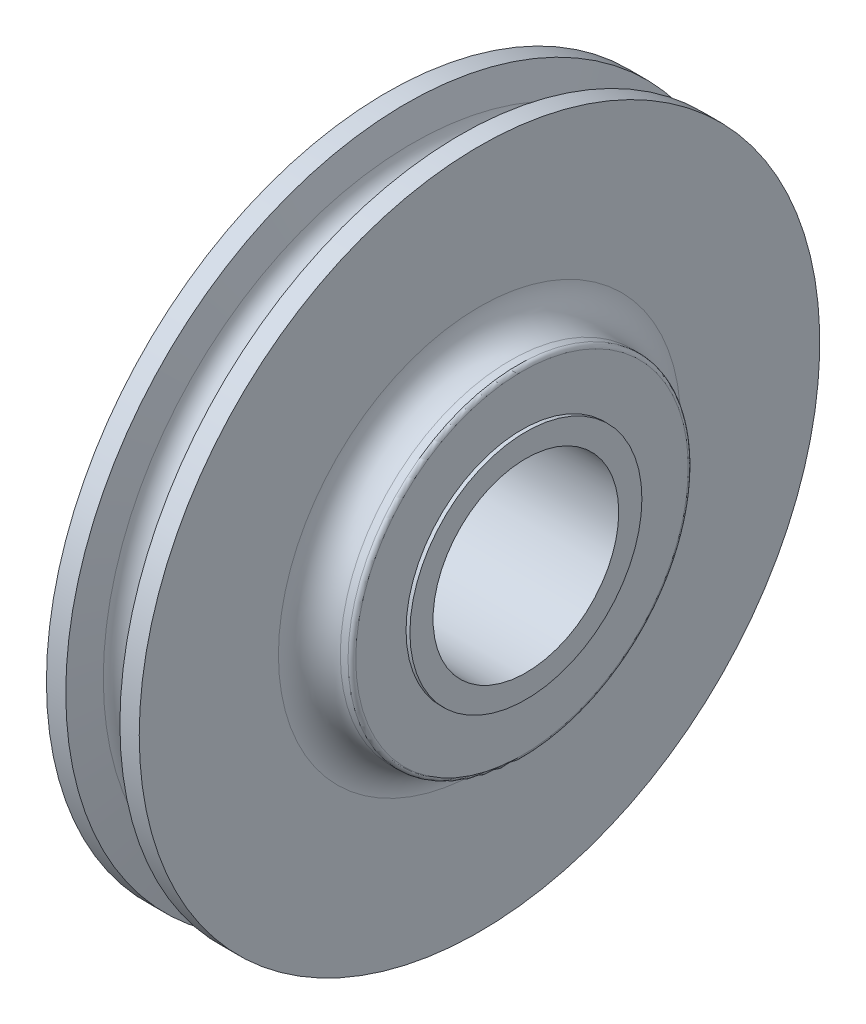
ISO-10303-21;
HEADER;
FILE_DESCRIPTION(('STEP AP214'),'2;1');
FILE_NAME('part.step','',(''),(''),'','','');
FILE_SCHEMA(('AUTOMOTIVE_DESIGN { 1 0 10303 214 1 1 1 1 }'));
ENDSEC;
DATA;
#1=APPLICATION_CONTEXT('core data for automotive mechanical design processes');
#2=APPLICATION_PROTOCOL_DEFINITION('international standard','automotive_design',2000,#1);
#3=PRODUCT_CONTEXT('',#1,'mechanical');
#4=PRODUCT('Part','Part','',(#3));
#5=PRODUCT_RELATED_PRODUCT_CATEGORY('part','',(#4));
#6=PRODUCT_DEFINITION_FORMATION('','',#4);
#7=PRODUCT_DEFINITION_CONTEXT('part definition',#1,'design');
#8=PRODUCT_DEFINITION('design','',#6,#7);
#9=PRODUCT_DEFINITION_SHAPE('','',#8);
#10=(LENGTH_UNIT() NAMED_UNIT(*) SI_UNIT(.MILLI.,.METRE.));
#11=(NAMED_UNIT(*) PLANE_ANGLE_UNIT() SI_UNIT($,.RADIAN.));
#12=(NAMED_UNIT(*) SI_UNIT($,.STERADIAN.) SOLID_ANGLE_UNIT());
#13=UNCERTAINTY_MEASURE_WITH_UNIT(LENGTH_MEASURE(1.E-05),#10,'distance_accuracy_value','');
#14=(GEOMETRIC_REPRESENTATION_CONTEXT(3) GLOBAL_UNCERTAINTY_ASSIGNED_CONTEXT((#13)) GLOBAL_UNIT_ASSIGNED_CONTEXT((#10,
#11,#12)) REPRESENTATION_CONTEXT('',''));
#15=CARTESIAN_POINT('',(0.,0.,0.));
#16=DIRECTION('',(0.,0.,1.));
#17=DIRECTION('',(1.,0.,0.));
#18=AXIS2_PLACEMENT_3D('',#15,#16,#17);
#19=CARTESIAN_POINT('',(31.75,0.,0.));
#20=DIRECTION('',(-1.,0.,0.));
#21=DIRECTION('',(0.,0.,1.));
#22=AXIS2_PLACEMENT_3D('',#19,#20,#21);
#23=TOROIDAL_SURFACE('',#22,82.5499999999997,12.7);
#24=CARTESIAN_POINT('',(19.05,0.,0.));
#25=DIRECTION('',(-1.,0.,0.));
#26=DIRECTION('',(0.,0.,1.));
#27=AXIS2_PLACEMENT_3D('',#24,#25,#26);
#28=CIRCLE('',#27,82.5499999999997);
#29=CARTESIAN_POINT('',(19.05,0.,82.5499999999997));
#30=VERTEX_POINT('',#29);
#31=EDGE_CURVE('E10',#30,#30,#28,.T.);
#32=ORIENTED_EDGE('',*,*,#31,.F.);
#33=EDGE_LOOP('',(#32));
#34=FACE_BOUND('',#33,.T.);
#35=CARTESIAN_POINT('',(31.75,0.,0.));
#36=DIRECTION('',(-1.,0.,0.));
#37=DIRECTION('',(0.,0.,1.));
#38=AXIS2_PLACEMENT_3D('',#35,#36,#37);
#39=CIRCLE('',#38,69.8499999999997);
#40=CARTESIAN_POINT('',(31.75,0.,69.8499999999997));
#41=VERTEX_POINT('',#40);
#42=EDGE_CURVE('E429',#41,#41,#39,.T.);
#43=ORIENTED_EDGE('',*,*,#42,.T.);
#44=EDGE_LOOP('',(#43));
#45=FACE_BOUND('',#44,.T.);
#46=ADVANCED_FACE('F371',(#34,#45),#23,.F.);
#47=CARTESIAN_POINT('',(19.05,139.7,0.));
#48=DIRECTION('',(-1.,0.,0.));
#49=DIRECTION('',(0.,0.,1.));
#50=AXIS2_PLACEMENT_3D('',#47,#48,#49);
#51=PLANE('',#50);
#52=CARTESIAN_POINT('',(19.05,0.,0.));
#53=DIRECTION('',(-1.,0.,0.));
#54=DIRECTION('',(0.,0.,1.));
#55=AXIS2_PLACEMENT_3D('',#52,#53,#54);
#56=CIRCLE('',#55,139.7);
#57=CARTESIAN_POINT('',(19.05,0.,139.7));
#58=VERTEX_POINT('',#57);
#59=EDGE_CURVE('E377',#58,#58,#56,.T.);
#60=ORIENTED_EDGE('',*,*,#59,.F.);
#61=EDGE_LOOP('',(#60));
#62=FACE_BOUND('',#61,.T.);
#63=ORIENTED_EDGE('',*,*,#31,.T.);
#64=EDGE_LOOP('',(#63));
#65=FACE_BOUND('',#64,.T.);
#66=ADVANCED_FACE('F462',(#62,#65),#51,.F.);
#67=CARTESIAN_POINT('',(-38.1,0.,0.));
#68=DIRECTION('',(-1.,0.,0.));
#69=DIRECTION('',(0.,0.,1.));
#70=AXIS2_PLACEMENT_3D('',#67,#68,#69);
#71=CYLINDRICAL_SURFACE('',#70,139.7);
#72=CARTESIAN_POINT('',(11.1125,0.,0.));
#73=DIRECTION('',(-1.,0.,0.));
#74=DIRECTION('',(0.,0.,1.));
#75=AXIS2_PLACEMENT_3D('',#72,#73,#74);
#76=CIRCLE('',#75,139.7);
#77=CARTESIAN_POINT('',(11.1125,0.,139.7));
#78=VERTEX_POINT('',#77);
#79=EDGE_CURVE('E381',#78,#78,#76,.T.);
#80=ORIENTED_EDGE('',*,*,#79,.F.);
#81=EDGE_LOOP('',(#80));
#82=FACE_BOUND('',#81,.T.);
#83=ORIENTED_EDGE('',*,*,#59,.T.);
#84=EDGE_LOOP('',(#83));
#85=FACE_BOUND('',#84,.T.);
#86=ADVANCED_FACE('F467',(#82,#85),#71,.T.);
#87=CARTESIAN_POINT('',(11.1125,0.,0.));
#88=DIRECTION('',(1.,0.,0.));
#89=DIRECTION('',(0.,0.,-1.));
#90=AXIS2_PLACEMENT_3D('',#87,#88,#89);
#91=CONICAL_SURFACE('',#90,139.7,1.37329185721072);
#92=CARTESIAN_POINT('',(8.5428288285911,0.,0.));
#93=DIRECTION('',(-1.,0.,0.));
#94=DIRECTION('',(0.,0.,1.));
#95=AXIS2_PLACEMENT_3D('',#92,#93,#94);
#96=CIRCLE('',#95,126.858916600095);
#97=CARTESIAN_POINT('',(8.5428288285911,0.,126.858916600095));
#98=VERTEX_POINT('',#97);
#99=EDGE_CURVE('E385',#98,#98,#96,.T.);
#100=ORIENTED_EDGE('',*,*,#99,.F.);
#101=EDGE_LOOP('',(#100));
#102=FACE_BOUND('',#101,.T.);
#103=ORIENTED_EDGE('',*,*,#79,.T.);
#104=EDGE_LOOP('',(#103));
#105=FACE_BOUND('',#104,.T.);
#106=ADVANCED_FACE('F547',(#102,#105),#91,.T.);
#107=CARTESIAN_POINT('',(0.,0.,0.));
#108=DIRECTION('',(-1.,0.,0.));
#109=DIRECTION('',(0.,0.,1.));
#110=AXIS2_PLACEMENT_3D('',#107,#108,#109);
#111=TOROIDAL_SURFACE('',#110,128.56845,8.71219999999997);
#112=CARTESIAN_POINT('',(-8.54282882859091,0.,0.));
#113=DIRECTION('',(-1.,0.,0.));
#114=DIRECTION('',(0.,0.,1.));
#115=AXIS2_PLACEMENT_3D('',#112,#113,#114);
#116=CIRCLE('',#115,126.858916600095);
#117=CARTESIAN_POINT('',(-8.54282882859091,0.,126.858916600095));
#118=VERTEX_POINT('',#117);
#119=EDGE_CURVE('E390',#118,#118,#116,.T.);
#120=ORIENTED_EDGE('',*,*,#119,.F.);
#121=EDGE_LOOP('',(#120));
#122=FACE_BOUND('',#121,.T.);
#123=ORIENTED_EDGE('',*,*,#99,.T.);
#124=EDGE_LOOP('',(#123));
#125=FACE_BOUND('',#124,.T.);
#126=ADVANCED_FACE('F541',(#122,#125),#111,.F.);
#127=CARTESIAN_POINT('',(-8.54282882859091,0.,0.));
#128=DIRECTION('',(-1.,0.,0.));
#129=DIRECTION('',(0.,0.,1.));
#130=AXIS2_PLACEMENT_3D('',#127,#128,#129);
#131=CONICAL_SURFACE('',#130,126.858916600095,1.3732918572107);
#132=CARTESIAN_POINT('',(-11.1125,0.,0.));
#133=DIRECTION('',(-1.,0.,0.));
#134=DIRECTION('',(0.,0.,1.));
#135=AXIS2_PLACEMENT_3D('',#132,#133,#134);
#136=CIRCLE('',#135,139.7);
#137=CARTESIAN_POINT('',(-11.1125,0.,139.7));
#138=VERTEX_POINT('',#137);
#139=EDGE_CURVE('E393',#138,#138,#136,.T.);
#140=ORIENTED_EDGE('',*,*,#139,.F.);
#141=EDGE_LOOP('',(#140));
#142=FACE_BOUND('',#141,.T.);
#143=ORIENTED_EDGE('',*,*,#119,.T.);
#144=EDGE_LOOP('',(#143));
#145=FACE_BOUND('',#144,.T.);
#146=ADVANCED_FACE('F535',(#142,#145),#131,.T.);
#147=CARTESIAN_POINT('',(-38.1,0.,0.));
#148=DIRECTION('',(-1.,0.,0.));
#149=DIRECTION('',(0.,0.,1.));
#150=AXIS2_PLACEMENT_3D('',#147,#148,#149);
#151=CYLINDRICAL_SURFACE('',#150,139.7);
#152=CARTESIAN_POINT('',(-19.05,0.,0.));
#153=DIRECTION('',(-1.,0.,0.));
#154=DIRECTION('',(0.,0.,1.));
#155=AXIS2_PLACEMENT_3D('',#152,#153,#154);
#156=CIRCLE('',#155,139.7);
#157=CARTESIAN_POINT('',(-19.05,0.,139.7));
#158=VERTEX_POINT('',#157);
#159=EDGE_CURVE('E396',#158,#158,#156,.T.);
#160=ORIENTED_EDGE('',*,*,#159,.F.);
#161=EDGE_LOOP('',(#160));
#162=FACE_BOUND('',#161,.T.);
#163=ORIENTED_EDGE('',*,*,#139,.T.);
#164=EDGE_LOOP('',(#163));
#165=FACE_BOUND('',#164,.T.);
#166=ADVANCED_FACE('F529',(#162,#165),#151,.T.);
#167=CARTESIAN_POINT('',(-19.05,139.7,0.));
#168=DIRECTION('',(1.,0.,0.));
#169=DIRECTION('',(0.,0.,-1.));
#170=AXIS2_PLACEMENT_3D('',#167,#168,#169);
#171=PLANE('',#170);
#172=CARTESIAN_POINT('',(-19.05,0.,0.));
#173=DIRECTION('',(-1.,0.,0.));
#174=DIRECTION('',(0.,0.,1.));
#175=AXIS2_PLACEMENT_3D('',#172,#173,#174);
#176=CIRCLE('',#175,82.5499999999997);
#177=CARTESIAN_POINT('',(-19.05,0.,82.5499999999997));
#178=VERTEX_POINT('',#177);
#179=EDGE_CURVE('E399',#178,#178,#176,.T.);
#180=ORIENTED_EDGE('',*,*,#179,.F.);
#181=EDGE_LOOP('',(#180));
#182=FACE_BOUND('',#181,.T.);
#183=ORIENTED_EDGE('',*,*,#159,.T.);
#184=EDGE_LOOP('',(#183));
#185=FACE_BOUND('',#184,.T.);
#186=ADVANCED_FACE('F523',(#182,#185),#171,.F.);
#187=CARTESIAN_POINT('',(-31.75,0.,0.));
#188=DIRECTION('',(-1.,0.,0.));
#189=DIRECTION('',(0.,0.,1.));
#190=AXIS2_PLACEMENT_3D('',#187,#188,#189);
#191=TOROIDAL_SURFACE('',#190,82.5499999999997,12.7);
#192=CARTESIAN_POINT('',(-31.75,0.,0.));
#193=DIRECTION('',(-1.,0.,0.));
#194=DIRECTION('',(0.,0.,1.));
#195=AXIS2_PLACEMENT_3D('',#192,#193,#194);
#196=CIRCLE('',#195,69.8499999999997);
#197=CARTESIAN_POINT('',(-31.75,0.,69.8499999999997));
#198=VERTEX_POINT('',#197);
#199=EDGE_CURVE('E402',#198,#198,#196,.T.);
#200=ORIENTED_EDGE('',*,*,#199,.F.);
#201=EDGE_LOOP('',(#200));
#202=FACE_BOUND('',#201,.T.);
#203=ORIENTED_EDGE('',*,*,#179,.T.);
#204=EDGE_LOOP('',(#203));
#205=FACE_BOUND('',#204,.T.);
#206=ADVANCED_FACE('F517',(#202,#205),#191,.F.);
#207=CARTESIAN_POINT('',(-38.1,0.,0.));
#208=DIRECTION('',(-1.,0.,0.));
#209=DIRECTION('',(0.,0.,1.));
#210=AXIS2_PLACEMENT_3D('',#207,#208,#209);
#211=CYLINDRICAL_SURFACE('',#210,69.8499999999997);
#212=CARTESIAN_POINT('',(-34.925,0.,0.));
#213=DIRECTION('',(-1.,0.,0.));
#214=DIRECTION('',(0.,0.,1.));
#215=AXIS2_PLACEMENT_3D('',#212,#213,#214);
#216=CIRCLE('',#215,69.8499999999997);
#217=CARTESIAN_POINT('',(-34.925,0.,69.8499999999997));
#218=VERTEX_POINT('',#217);
#219=EDGE_CURVE('E405',#218,#218,#216,.T.);
#220=ORIENTED_EDGE('',*,*,#219,.F.);
#221=EDGE_LOOP('',(#220));
#222=FACE_BOUND('',#221,.T.);
#223=ORIENTED_EDGE('',*,*,#199,.T.);
#224=EDGE_LOOP('',(#223));
#225=FACE_BOUND('',#224,.T.);
#226=ADVANCED_FACE('F511',(#222,#225),#211,.T.);
#227=CARTESIAN_POINT('',(-34.925,0.,0.));
#228=DIRECTION('',(-1.,0.,0.));
#229=DIRECTION('',(0.,0.,1.));
#230=AXIS2_PLACEMENT_3D('',#227,#228,#229);
#231=TOROIDAL_SURFACE('',#230,68.2624999999997,1.58749999999999);
#232=CARTESIAN_POINT('',(-36.5125,0.,0.));
#233=DIRECTION('',(-1.,0.,0.));
#234=DIRECTION('',(0.,0.,1.));
#235=AXIS2_PLACEMENT_3D('',#232,#233,#234);
#236=CIRCLE('',#235,68.2624999999997);
#237=CARTESIAN_POINT('',(-36.5125,0.,68.2624999999997));
#238=VERTEX_POINT('',#237);
#239=EDGE_CURVE('E408',#238,#238,#236,.T.);
#240=ORIENTED_EDGE('',*,*,#239,.F.);
#241=EDGE_LOOP('',(#240));
#242=FACE_BOUND('',#241,.T.);
#243=ORIENTED_EDGE('',*,*,#219,.T.);
#244=EDGE_LOOP('',(#243));
#245=FACE_BOUND('',#244,.T.);
#246=ADVANCED_FACE('F505',(#242,#245),#231,.T.);
#247=CARTESIAN_POINT('',(-36.5125,68.2624999999997,0.));
#248=DIRECTION('',(1.,0.,0.));
#249=DIRECTION('',(0.,0.,-1.));
#250=AXIS2_PLACEMENT_3D('',#247,#248,#249);
#251=PLANE('',#250);
#252=CARTESIAN_POINT('',(-36.5125,0.,0.));
#253=DIRECTION('',(-1.,0.,0.));
#254=DIRECTION('',(0.,0.,1.));
#255=AXIS2_PLACEMENT_3D('',#252,#253,#254);
#256=CIRCLE('',#255,47.625);
#257=CARTESIAN_POINT('',(-36.5125,0.,47.625));
#258=VERTEX_POINT('',#257);
#259=EDGE_CURVE('E411',#258,#258,#256,.T.);
#260=ORIENTED_EDGE('',*,*,#259,.F.);
#261=EDGE_LOOP('',(#260));
#262=FACE_BOUND('',#261,.T.);
#263=ORIENTED_EDGE('',*,*,#239,.T.);
#264=EDGE_LOOP('',(#263));
#265=FACE_BOUND('',#264,.T.);
#266=ADVANCED_FACE('F499',(#262,#265),#251,.F.);
#267=CARTESIAN_POINT('',(-38.1,0.,0.));
#268=DIRECTION('',(-1.,0.,0.));
#269=DIRECTION('',(0.,0.,1.));
#270=AXIS2_PLACEMENT_3D('',#267,#268,#269);
#271=CYLINDRICAL_SURFACE('',#270,47.625);
#272=CARTESIAN_POINT('',(-38.1,0.,0.));
#273=DIRECTION('',(-1.,0.,0.));
#274=DIRECTION('',(0.,0.,1.));
#275=AXIS2_PLACEMENT_3D('',#272,#273,#274);
#276=CIRCLE('',#275,47.625);
#277=CARTESIAN_POINT('',(-38.1,0.,47.625));
#278=VERTEX_POINT('',#277);
#279=EDGE_CURVE('E414',#278,#278,#276,.T.);
#280=ORIENTED_EDGE('',*,*,#279,.F.);
#281=EDGE_LOOP('',(#280));
#282=FACE_BOUND('',#281,.T.);
#283=ORIENTED_EDGE('',*,*,#259,.T.);
#284=EDGE_LOOP('',(#283));
#285=FACE_BOUND('',#284,.T.);
#286=ADVANCED_FACE('F494',(#282,#285),#271,.T.);
#287=CARTESIAN_POINT('',(-38.1,47.625,0.));
#288=DIRECTION('',(1.,0.,0.));
#289=DIRECTION('',(0.,0.,-1.));
#290=AXIS2_PLACEMENT_3D('',#287,#288,#289);
#291=PLANE('',#290);
#292=CARTESIAN_POINT('',(-38.1,0.,0.));
#293=DIRECTION('',(1.,0.,0.));
#294=DIRECTION('',(0.,0.,-1.));
#295=AXIS2_PLACEMENT_3D('',#292,#293,#294);
#296=CIRCLE('',#295,38.1127);
#297=CARTESIAN_POINT('',(-38.1,0.,-38.1127));
#298=VERTEX_POINT('',#297);
#299=EDGE_CURVE('E432',#298,#298,#296,.T.);
#300=ORIENTED_EDGE('',*,*,#299,.T.);
#301=EDGE_LOOP('',(#300));
#302=FACE_BOUND('',#301,.T.);
#303=ORIENTED_EDGE('',*,*,#279,.T.);
#304=EDGE_LOOP('',(#303));
#305=FACE_BOUND('',#304,.T.);
#306=ADVANCED_FACE('F445',(#302,#305),#291,.F.);
#307=CARTESIAN_POINT('',(38.1,47.625,0.));
#308=DIRECTION('',(-1.,0.,0.));
#309=DIRECTION('',(0.,0.,1.));
#310=AXIS2_PLACEMENT_3D('',#307,#308,#309);
#311=PLANE('',#310);
#312=CARTESIAN_POINT('',(38.1,0.,0.));
#313=DIRECTION('',(1.,0.,0.));
#314=DIRECTION('',(0.,0.,-1.));
#315=AXIS2_PLACEMENT_3D('',#312,#313,#314);
#316=CIRCLE('',#315,38.1127);
#317=CARTESIAN_POINT('',(38.1,0.,-38.1127));
#318=VERTEX_POINT('',#317);
#319=EDGE_CURVE('E435',#318,#318,#316,.T.);
#320=ORIENTED_EDGE('',*,*,#319,.F.);
#321=EDGE_LOOP('',(#320));
#322=FACE_BOUND('',#321,.T.);
#323=CARTESIAN_POINT('',(38.1,0.,0.));
#324=DIRECTION('',(-1.,0.,0.));
#325=DIRECTION('',(0.,0.,1.));
#326=AXIS2_PLACEMENT_3D('',#323,#324,#325);
#327=CIRCLE('',#326,47.625);
#328=CARTESIAN_POINT('',(38.1,0.,47.625));
#329=VERTEX_POINT('',#328);
#330=EDGE_CURVE('E417',#329,#329,#327,.T.);
#331=ORIENTED_EDGE('',*,*,#330,.F.);
#332=EDGE_LOOP('',(#331));
#333=FACE_BOUND('',#332,.T.);
#334=ADVANCED_FACE('F441',(#322,#333),#311,.F.);
#335=CARTESIAN_POINT('',(-38.1,0.,0.));
#336=DIRECTION('',(-1.,0.,0.));
#337=DIRECTION('',(0.,0.,1.));
#338=AXIS2_PLACEMENT_3D('',#335,#336,#337);
#339=CYLINDRICAL_SURFACE('',#338,47.625);
#340=CARTESIAN_POINT('',(36.5125,0.,0.));
#341=DIRECTION('',(-1.,0.,0.));
#342=DIRECTION('',(0.,0.,1.));
#343=AXIS2_PLACEMENT_3D('',#340,#341,#342);
#344=CIRCLE('',#343,47.625);
#345=CARTESIAN_POINT('',(36.5125,0.,47.625));
#346=VERTEX_POINT('',#345);
#347=EDGE_CURVE('E420',#346,#346,#344,.T.);
#348=ORIENTED_EDGE('',*,*,#347,.F.);
#349=EDGE_LOOP('',(#348));
#350=FACE_BOUND('',#349,.T.);
#351=ORIENTED_EDGE('',*,*,#330,.T.);
#352=EDGE_LOOP('',(#351));
#353=FACE_BOUND('',#352,.T.);
#354=ADVANCED_FACE('F444',(#350,#353),#339,.T.);
#355=CARTESIAN_POINT('',(36.5125,68.2624999999997,0.));
#356=DIRECTION('',(-1.,0.,0.));
#357=DIRECTION('',(0.,0.,1.));
#358=AXIS2_PLACEMENT_3D('',#355,#356,#357);
#359=PLANE('',#358);
#360=CARTESIAN_POINT('',(36.5125,0.,0.));
#361=DIRECTION('',(-1.,0.,0.));
#362=DIRECTION('',(0.,0.,1.));
#363=AXIS2_PLACEMENT_3D('',#360,#361,#362);
#364=CIRCLE('',#363,68.2624999999997);
#365=CARTESIAN_POINT('',(36.5125,0.,68.2624999999997));
#366=VERTEX_POINT('',#365);
#367=EDGE_CURVE('E423',#366,#366,#364,.T.);
#368=ORIENTED_EDGE('',*,*,#367,.F.);
#369=EDGE_LOOP('',(#368));
#370=FACE_BOUND('',#369,.T.);
#371=ORIENTED_EDGE('',*,*,#347,.T.);
#372=EDGE_LOOP('',(#371));
#373=FACE_BOUND('',#372,.T.);
#374=ADVANCED_FACE('F450',(#370,#373),#359,.F.);
#375=CARTESIAN_POINT('',(34.925,0.,0.));
#376=DIRECTION('',(-1.,0.,0.));
#377=DIRECTION('',(0.,0.,1.));
#378=AXIS2_PLACEMENT_3D('',#375,#376,#377);
#379=TOROIDAL_SURFACE('',#378,68.2624999999997,1.58749999999999);
#380=CARTESIAN_POINT('',(34.925,0.,0.));
#381=DIRECTION('',(-1.,0.,0.));
#382=DIRECTION('',(0.,0.,1.));
#383=AXIS2_PLACEMENT_3D('',#380,#381,#382);
#384=CIRCLE('',#383,69.8499999999997);
#385=CARTESIAN_POINT('',(34.925,0.,69.8499999999997));
#386=VERTEX_POINT('',#385);
#387=EDGE_CURVE('E426',#386,#386,#384,.T.);
#388=ORIENTED_EDGE('',*,*,#387,.F.);
#389=EDGE_LOOP('',(#388));
#390=FACE_BOUND('',#389,.T.);
#391=ORIENTED_EDGE('',*,*,#367,.T.);
#392=EDGE_LOOP('',(#391));
#393=FACE_BOUND('',#392,.T.);
#394=ADVANCED_FACE('F457',(#390,#393),#379,.T.);
#395=CARTESIAN_POINT('',(-38.1,0.,0.));
#396=DIRECTION('',(-1.,0.,0.));
#397=DIRECTION('',(0.,0.,1.));
#398=AXIS2_PLACEMENT_3D('',#395,#396,#397);
#399=CYLINDRICAL_SURFACE('',#398,69.8499999999997);
#400=ORIENTED_EDGE('',*,*,#42,.F.);
#401=EDGE_LOOP('',(#400));
#402=FACE_BOUND('',#401,.T.);
#403=ORIENTED_EDGE('',*,*,#387,.T.);
#404=EDGE_LOOP('',(#403));
#405=FACE_BOUND('',#404,.T.);
#406=ADVANCED_FACE('F472',(#402,#405),#399,.T.);
#407=CARTESIAN_POINT('',(-38.1,0.,0.));
#408=DIRECTION('',(1.,0.,0.));
#409=DIRECTION('',(0.,0.,-1.));
#410=AXIS2_PLACEMENT_3D('',#407,#408,#409);
#411=CYLINDRICAL_SURFACE('',#410,38.1127);
#412=ORIENTED_EDGE('',*,*,#299,.F.);
#413=EDGE_LOOP('',(#412));
#414=FACE_BOUND('',#413,.T.);
#415=ORIENTED_EDGE('',*,*,#319,.T.);
#416=EDGE_LOOP('',(#415));
#417=FACE_BOUND('',#416,.T.);
#418=ADVANCED_FACE('F439',(#414,#417),#411,.F.);
#419=CLOSED_SHELL('',(#46,#66,#86,#106,#126,#146,#166,#186,#206,#226,#246,#266,#286,#306,#334,
#354,#374,#394,#406,#418));
#420=MANIFOLD_SOLID_BREP('B2',#419);
#421=ADVANCED_BREP_SHAPE_REPRESENTATION('',(#18,#420),#14);
#422=SHAPE_DEFINITION_REPRESENTATION(#9,#421);
ENDSEC;
END-ISO-10303-21;
